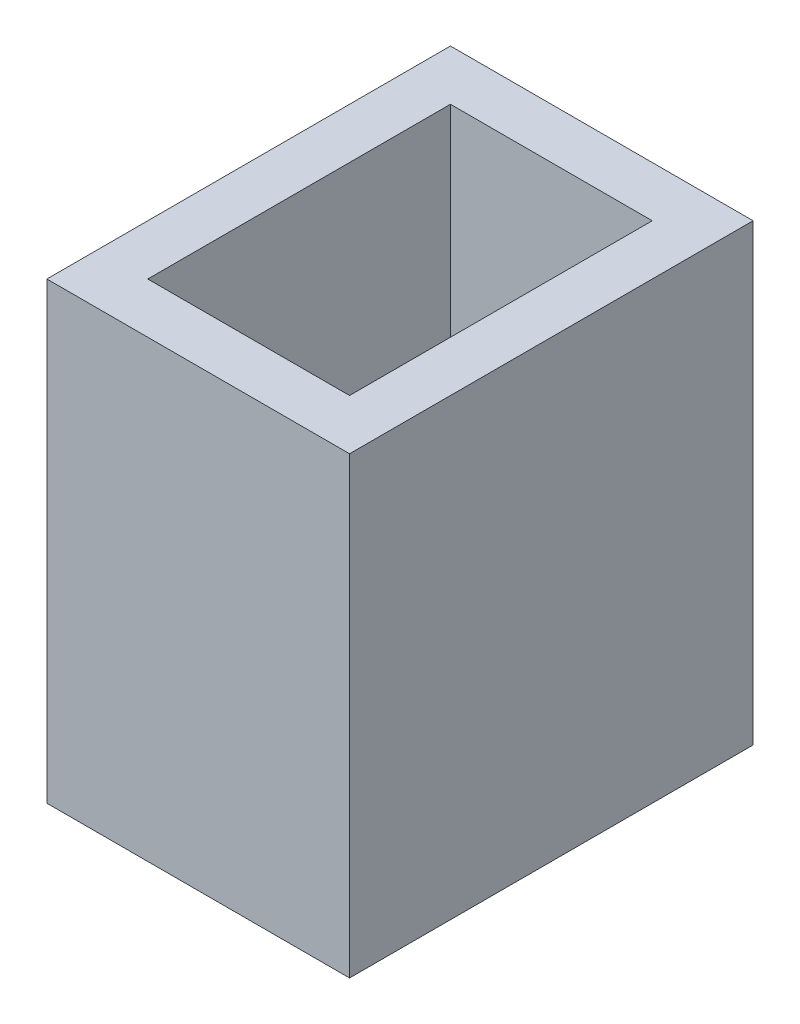
ISO-10303-21;
HEADER;
FILE_DESCRIPTION(('STEP AP214'),'2;1');
FILE_NAME('part.step','',(''),(''),'','','');
FILE_SCHEMA(('AUTOMOTIVE_DESIGN { 1 0 10303 214 1 1 1 1 }'));
ENDSEC;
DATA;
#1=APPLICATION_CONTEXT('core data for automotive mechanical design processes');
#2=APPLICATION_PROTOCOL_DEFINITION('international standard','automotive_design',2000,#1);
#3=PRODUCT_CONTEXT('',#1,'mechanical');
#4=PRODUCT('Part','Part','',(#3));
#5=PRODUCT_RELATED_PRODUCT_CATEGORY('part','',(#4));
#6=PRODUCT_DEFINITION_FORMATION('','',#4);
#7=PRODUCT_DEFINITION_CONTEXT('part definition',#1,'design');
#8=PRODUCT_DEFINITION('design','',#6,#7);
#9=PRODUCT_DEFINITION_SHAPE('','',#8);
#10=(LENGTH_UNIT() NAMED_UNIT(*) SI_UNIT(.MILLI.,.METRE.));
#11=(NAMED_UNIT(*) PLANE_ANGLE_UNIT() SI_UNIT($,.RADIAN.));
#12=(NAMED_UNIT(*) SI_UNIT($,.STERADIAN.) SOLID_ANGLE_UNIT());
#13=UNCERTAINTY_MEASURE_WITH_UNIT(LENGTH_MEASURE(1.E-05),#10,'distance_accuracy_value','');
#14=(GEOMETRIC_REPRESENTATION_CONTEXT(3) GLOBAL_UNCERTAINTY_ASSIGNED_CONTEXT((#13)) GLOBAL_UNIT_ASSIGNED_CONTEXT((#10,
#11,#12)) REPRESENTATION_CONTEXT('',''));
#15=CARTESIAN_POINT('',(0.,0.,0.));
#16=DIRECTION('',(0.,0.,1.));
#17=DIRECTION('',(1.,0.,0.));
#18=AXIS2_PLACEMENT_3D('',#15,#16,#17);
#19=CARTESIAN_POINT('',(0.,18.,0.));
#20=DIRECTION('',(0.,-1.,0.));
#21=DIRECTION('',(0.,0.,-1.));
#22=AXIS2_PLACEMENT_3D('',#19,#20,#21);
#23=PLANE('',#22);
#24=DIRECTION('',(0.,0.,1.));
#25=VECTOR('',#24,1.);
#26=CARTESIAN_POINT('',(0.,18.,0.));
#27=LINE('',#26,#25);
#28=CARTESIAN_POINT('',(0.,18.,-16.));
#29=VERTEX_POINT('',#28);
#30=CARTESIAN_POINT('',(0.,18.,0.));
#31=VERTEX_POINT('',#30);
#32=EDGE_CURVE('E165',#29,#31,#27,.T.);
#33=ORIENTED_EDGE('',*,*,#32,.T.);
#34=DIRECTION('',(1.,0.,0.));
#35=VECTOR('',#34,1.);
#36=CARTESIAN_POINT('',(0.,18.,0.));
#37=LINE('',#36,#35);
#38=CARTESIAN_POINT('',(12.,18.,0.));
#39=VERTEX_POINT('',#38);
#40=EDGE_CURVE('E100',#31,#39,#37,.T.);
#41=ORIENTED_EDGE('',*,*,#40,.T.);
#42=DIRECTION('',(0.,0.,-1.));
#43=VECTOR('',#42,1.);
#44=CARTESIAN_POINT('',(12.,18.,0.));
#45=LINE('',#44,#43);
#46=CARTESIAN_POINT('',(12.,18.,-16.));
#47=VERTEX_POINT('',#46);
#48=EDGE_CURVE('E170',#39,#47,#45,.T.);
#49=ORIENTED_EDGE('',*,*,#48,.T.);
#50=DIRECTION('',(-1.,0.,0.));
#51=VECTOR('',#50,1.);
#52=CARTESIAN_POINT('',(0.,18.,-16.));
#53=LINE('',#52,#51);
#54=EDGE_CURVE('E72',#47,#29,#53,.T.);
#55=ORIENTED_EDGE('',*,*,#54,.T.);
#56=EDGE_LOOP('',(#33,#41,#49,#55));
#57=FACE_BOUND('',#56,.T.);
#58=DIRECTION('',(0.,0.,1.));
#59=VECTOR('',#58,1.);
#60=CARTESIAN_POINT('',(2.,18.,0.));
#61=LINE('',#60,#59);
#62=CARTESIAN_POINT('',(2.,18.,-14.));
#63=VERTEX_POINT('',#62);
#64=CARTESIAN_POINT('',(2.,18.,-2.));
#65=VERTEX_POINT('',#64);
#66=EDGE_CURVE('E149',#63,#65,#61,.T.);
#67=ORIENTED_EDGE('',*,*,#66,.F.);
#68=DIRECTION('',(-1.,0.,0.));
#69=VECTOR('',#68,1.);
#70=CARTESIAN_POINT('',(0.,18.,-14.));
#71=LINE('',#70,#69);
#72=CARTESIAN_POINT('',(10.,18.,-14.));
#73=VERTEX_POINT('',#72);
#74=EDGE_CURVE('E162',#73,#63,#71,.T.);
#75=ORIENTED_EDGE('',*,*,#74,.F.);
#76=DIRECTION('',(0.,0.,-1.));
#77=VECTOR('',#76,1.);
#78=CARTESIAN_POINT('',(10.,18.,0.));
#79=LINE('',#78,#77);
#80=CARTESIAN_POINT('',(10.,18.,-2.));
#81=VERTEX_POINT('',#80);
#82=EDGE_CURVE('E159',#81,#73,#79,.T.);
#83=ORIENTED_EDGE('',*,*,#82,.F.);
#84=DIRECTION('',(1.,0.,0.));
#85=VECTOR('',#84,1.);
#86=CARTESIAN_POINT('',(0.,18.,-2.));
#87=LINE('',#86,#85);
#88=EDGE_CURVE('E138',#65,#81,#87,.T.);
#89=ORIENTED_EDGE('',*,*,#88,.F.);
#90=EDGE_LOOP('',(#67,#75,#83,#89));
#91=FACE_BOUND('',#90,.T.);
#92=ADVANCED_FACE('F45',(#57,#91),#23,.F.);
#93=CARTESIAN_POINT('',(0.,18.,0.));
#94=DIRECTION('',(1.,0.,0.));
#95=DIRECTION('',(0.,0.,-1.));
#96=AXIS2_PLACEMENT_3D('',#93,#94,#95);
#97=PLANE('',#96);
#98=DIRECTION('',(0.,0.,1.));
#99=VECTOR('',#98,1.);
#100=CARTESIAN_POINT('',(0.,0.,0.));
#101=LINE('',#100,#99);
#102=CARTESIAN_POINT('',(0.,0.,-16.));
#103=VERTEX_POINT('',#102);
#104=CARTESIAN_POINT('',(0.,0.,0.));
#105=VERTEX_POINT('',#104);
#106=EDGE_CURVE('E176',#103,#105,#101,.T.);
#107=ORIENTED_EDGE('',*,*,#106,.T.);
#108=DIRECTION('',(0.,-1.,0.));
#109=VECTOR('',#108,1.);
#110=CARTESIAN_POINT('',(0.,18.,0.));
#111=LINE('',#110,#109);
#112=EDGE_CURVE('E11',#31,#105,#111,.T.);
#113=ORIENTED_EDGE('',*,*,#112,.F.);
#114=ORIENTED_EDGE('',*,*,#32,.F.);
#115=DIRECTION('',(0.,-1.,0.));
#116=VECTOR('',#115,1.);
#117=CARTESIAN_POINT('',(0.,18.,-16.));
#118=LINE('',#117,#116);
#119=EDGE_CURVE('E175',#29,#103,#118,.T.);
#120=ORIENTED_EDGE('',*,*,#119,.T.);
#121=EDGE_LOOP('',(#107,#113,#114,#120));
#122=FACE_BOUND('',#121,.T.);
#123=ADVANCED_FACE('F47',(#122),#97,.F.);
#124=CARTESIAN_POINT('',(0.,18.,0.));
#125=DIRECTION('',(0.,0.,-1.));
#126=DIRECTION('',(-1.,0.,0.));
#127=AXIS2_PLACEMENT_3D('',#124,#125,#126);
#128=PLANE('',#127);
#129=DIRECTION('',(1.,0.,0.));
#130=VECTOR('',#129,1.);
#131=CARTESIAN_POINT('',(0.,0.,0.));
#132=LINE('',#131,#130);
#133=CARTESIAN_POINT('',(12.,0.,0.));
#134=VERTEX_POINT('',#133);
#135=EDGE_CURVE('E180',#105,#134,#132,.T.);
#136=ORIENTED_EDGE('',*,*,#135,.T.);
#137=DIRECTION('',(0.,-1.,0.));
#138=VECTOR('',#137,1.);
#139=CARTESIAN_POINT('',(12.,18.,0.));
#140=LINE('',#139,#138);
#141=EDGE_CURVE('E55',#39,#134,#140,.T.);
#142=ORIENTED_EDGE('',*,*,#141,.F.);
#143=ORIENTED_EDGE('',*,*,#40,.F.);
#144=ORIENTED_EDGE('',*,*,#112,.T.);
#145=EDGE_LOOP('',(#136,#142,#143,#144));
#146=FACE_BOUND('',#145,.T.);
#147=ADVANCED_FACE('F230',(#146),#128,.F.);
#148=CARTESIAN_POINT('',(12.,18.,0.));
#149=DIRECTION('',(-1.,0.,0.));
#150=DIRECTION('',(0.,0.,1.));
#151=AXIS2_PLACEMENT_3D('',#148,#149,#150);
#152=PLANE('',#151);
#153=DIRECTION('',(0.,0.,-1.));
#154=VECTOR('',#153,1.);
#155=CARTESIAN_POINT('',(12.,0.,0.));
#156=LINE('',#155,#154);
#157=CARTESIAN_POINT('',(12.,0.,-16.));
#158=VERTEX_POINT('',#157);
#159=EDGE_CURVE('E183',#134,#158,#156,.T.);
#160=ORIENTED_EDGE('',*,*,#159,.T.);
#161=DIRECTION('',(0.,-1.,0.));
#162=VECTOR('',#161,1.);
#163=CARTESIAN_POINT('',(12.,18.,-16.));
#164=LINE('',#163,#162);
#165=EDGE_CURVE('E190',#47,#158,#164,.T.);
#166=ORIENTED_EDGE('',*,*,#165,.F.);
#167=ORIENTED_EDGE('',*,*,#48,.F.);
#168=ORIENTED_EDGE('',*,*,#141,.T.);
#169=EDGE_LOOP('',(#160,#166,#167,#168));
#170=FACE_BOUND('',#169,.T.);
#171=ADVANCED_FACE('F242',(#170),#152,.F.);
#172=CARTESIAN_POINT('',(0.,18.,-16.));
#173=DIRECTION('',(0.,0.,1.));
#174=DIRECTION('',(1.,0.,0.));
#175=AXIS2_PLACEMENT_3D('',#172,#173,#174);
#176=PLANE('',#175);
#177=DIRECTION('',(-1.,0.,0.));
#178=VECTOR('',#177,1.);
#179=CARTESIAN_POINT('',(0.,0.,-16.));
#180=LINE('',#179,#178);
#181=EDGE_CURVE('E93',#158,#103,#180,.T.);
#182=ORIENTED_EDGE('',*,*,#181,.T.);
#183=ORIENTED_EDGE('',*,*,#119,.F.);
#184=ORIENTED_EDGE('',*,*,#54,.F.);
#185=ORIENTED_EDGE('',*,*,#165,.T.);
#186=EDGE_LOOP('',(#182,#183,#184,#185));
#187=FACE_BOUND('',#186,.T.);
#188=ADVANCED_FACE('F238',(#187),#176,.F.);
#189=CARTESIAN_POINT('',(0.,0.,0.));
#190=DIRECTION('',(0.,-1.,0.));
#191=DIRECTION('',(0.,0.,-1.));
#192=AXIS2_PLACEMENT_3D('',#189,#190,#191);
#193=PLANE('',#192);
#194=CARTESIAN_POINT('',(4.77011472098124,0.,-11.783836205576));
#195=DIRECTION('',(0.,-1.,0.));
#196=DIRECTION('',(0.,0.,-1.));
#197=AXIS2_PLACEMENT_3D('',#194,#195,#196);
#198=CIRCLE('',#197,0.75);
#199=CARTESIAN_POINT('',(4.77011472098124,0.,-12.533836205576));
#200=VERTEX_POINT('',#199);
#201=EDGE_CURVE('E386',#200,#200,#198,.T.);
#202=ORIENTED_EDGE('',*,*,#201,.F.);
#203=EDGE_LOOP('',(#202));
#204=FACE_BOUND('',#203,.T.);
#205=CARTESIAN_POINT('',(4.77011472159648,0.,-4.16383620557599));
#206=DIRECTION('',(0.,-1.,0.));
#207=DIRECTION('',(0.,0.,-1.));
#208=AXIS2_PLACEMENT_3D('',#205,#206,#207);
#209=CIRCLE('',#208,0.75);
#210=CARTESIAN_POINT('',(4.77011472159648,0.,-4.913836205576));
#211=VERTEX_POINT('',#210);
#212=EDGE_CURVE('E388',#211,#211,#209,.T.);
#213=ORIENTED_EDGE('',*,*,#212,.F.);
#214=EDGE_LOOP('',(#213));
#215=FACE_BOUND('',#214,.T.);
#216=CARTESIAN_POINT('',(4.77011472159674,0.,-6.70383620557594));
#217=DIRECTION('',(0.,-1.,0.));
#218=DIRECTION('',(0.,0.,-1.));
#219=AXIS2_PLACEMENT_3D('',#216,#217,#218);
#220=CIRCLE('',#219,0.75);
#221=CARTESIAN_POINT('',(4.77011472159674,0.,-7.45383620557594));
#222=VERTEX_POINT('',#221);
#223=EDGE_CURVE('E200',#222,#222,#220,.T.);
#224=ORIENTED_EDGE('',*,*,#223,.F.);
#225=EDGE_LOOP('',(#224));
#226=FACE_BOUND('',#225,.T.);
#227=ORIENTED_EDGE('',*,*,#106,.F.);
#228=ORIENTED_EDGE('',*,*,#181,.F.);
#229=ORIENTED_EDGE('',*,*,#159,.F.);
#230=ORIENTED_EDGE('',*,*,#135,.F.);
#231=EDGE_LOOP('',(#227,#228,#229,#230));
#232=FACE_BOUND('',#231,.T.);
#233=ADVANCED_FACE('F235',(#204,#215,#226,#232),#193,.T.);
#234=CARTESIAN_POINT('',(2.,18.,0.));
#235=DIRECTION('',(1.,0.,0.));
#236=DIRECTION('',(0.,0.,-1.));
#237=AXIS2_PLACEMENT_3D('',#234,#235,#236);
#238=PLANE('',#237);
#239=DIRECTION('',(0.,0.,1.));
#240=VECTOR('',#239,1.);
#241=CARTESIAN_POINT('',(2.,2.,0.));
#242=LINE('',#241,#240);
#243=CARTESIAN_POINT('',(2.,2.,-14.));
#244=VERTEX_POINT('',#243);
#245=CARTESIAN_POINT('',(2.,2.,-2.));
#246=VERTEX_POINT('',#245);
#247=EDGE_CURVE('E128',#244,#246,#242,.T.);
#248=ORIENTED_EDGE('',*,*,#247,.F.);
#249=DIRECTION('',(0.,-1.,0.));
#250=VECTOR('',#249,1.);
#251=CARTESIAN_POINT('',(2.,18.,-14.));
#252=LINE('',#251,#250);
#253=EDGE_CURVE('E153',#63,#244,#252,.T.);
#254=ORIENTED_EDGE('',*,*,#253,.F.);
#255=ORIENTED_EDGE('',*,*,#66,.T.);
#256=DIRECTION('',(0.,-1.,0.));
#257=VECTOR('',#256,1.);
#258=CARTESIAN_POINT('',(2.,18.,-2.));
#259=LINE('',#258,#257);
#260=EDGE_CURVE('E142',#65,#246,#259,.T.);
#261=ORIENTED_EDGE('',*,*,#260,.T.);
#262=EDGE_LOOP('',(#248,#254,#255,#261));
#263=FACE_BOUND('',#262,.T.);
#264=ADVANCED_FACE('F223',(#263),#238,.T.);
#265=CARTESIAN_POINT('',(0.,18.,-2.));
#266=DIRECTION('',(0.,0.,-1.));
#267=DIRECTION('',(-1.,0.,0.));
#268=AXIS2_PLACEMENT_3D('',#265,#266,#267);
#269=PLANE('',#268);
#270=DIRECTION('',(1.,0.,0.));
#271=VECTOR('',#270,1.);
#272=CARTESIAN_POINT('',(0.,2.,-2.));
#273=LINE('',#272,#271);
#274=CARTESIAN_POINT('',(10.,2.,-2.));
#275=VERTEX_POINT('',#274);
#276=EDGE_CURVE('E122',#246,#275,#273,.T.);
#277=ORIENTED_EDGE('',*,*,#276,.F.);
#278=ORIENTED_EDGE('',*,*,#260,.F.);
#279=ORIENTED_EDGE('',*,*,#88,.T.);
#280=DIRECTION('',(0.,-1.,0.));
#281=VECTOR('',#280,1.);
#282=CARTESIAN_POINT('',(10.,18.,-2.));
#283=LINE('',#282,#281);
#284=EDGE_CURVE('E135',#81,#275,#283,.T.);
#285=ORIENTED_EDGE('',*,*,#284,.T.);
#286=EDGE_LOOP('',(#277,#278,#279,#285));
#287=FACE_BOUND('',#286,.T.);
#288=ADVANCED_FACE('F136',(#287),#269,.T.);
#289=CARTESIAN_POINT('',(10.,18.,0.));
#290=DIRECTION('',(-1.,0.,0.));
#291=DIRECTION('',(0.,0.,1.));
#292=AXIS2_PLACEMENT_3D('',#289,#290,#291);
#293=PLANE('',#292);
#294=DIRECTION('',(0.,0.,-1.));
#295=VECTOR('',#294,1.);
#296=CARTESIAN_POINT('',(10.,2.,0.));
#297=LINE('',#296,#295);
#298=CARTESIAN_POINT('',(10.,2.,-14.));
#299=VERTEX_POINT('',#298);
#300=EDGE_CURVE('E126',#275,#299,#297,.T.);
#301=ORIENTED_EDGE('',*,*,#300,.F.);
#302=ORIENTED_EDGE('',*,*,#284,.F.);
#303=ORIENTED_EDGE('',*,*,#82,.T.);
#304=DIRECTION('',(0.,-1.,0.));
#305=VECTOR('',#304,1.);
#306=CARTESIAN_POINT('',(10.,18.,-14.));
#307=LINE('',#306,#305);
#308=EDGE_CURVE('E63',#73,#299,#307,.T.);
#309=ORIENTED_EDGE('',*,*,#308,.T.);
#310=EDGE_LOOP('',(#301,#302,#303,#309));
#311=FACE_BOUND('',#310,.T.);
#312=ADVANCED_FACE('F144',(#311),#293,.T.);
#313=CARTESIAN_POINT('',(0.,18.,-14.));
#314=DIRECTION('',(0.,0.,1.));
#315=DIRECTION('',(1.,0.,0.));
#316=AXIS2_PLACEMENT_3D('',#313,#314,#315);
#317=PLANE('',#316);
#318=DIRECTION('',(-1.,0.,0.));
#319=VECTOR('',#318,1.);
#320=CARTESIAN_POINT('',(0.,2.,-14.));
#321=LINE('',#320,#319);
#322=EDGE_CURVE('E146',#299,#244,#321,.T.);
#323=ORIENTED_EDGE('',*,*,#322,.F.);
#324=ORIENTED_EDGE('',*,*,#308,.F.);
#325=ORIENTED_EDGE('',*,*,#74,.T.);
#326=ORIENTED_EDGE('',*,*,#253,.T.);
#327=EDGE_LOOP('',(#323,#324,#325,#326));
#328=FACE_BOUND('',#327,.T.);
#329=ADVANCED_FACE('F219',(#328),#317,.T.);
#330=CARTESIAN_POINT('',(0.,2.,0.));
#331=DIRECTION('',(0.,-1.,0.));
#332=DIRECTION('',(0.,0.,-1.));
#333=AXIS2_PLACEMENT_3D('',#330,#331,#332);
#334=PLANE('',#333);
#335=CARTESIAN_POINT('',(4.77011472098124,2.,-11.783836205576));
#336=DIRECTION('',(0.,-1.,0.));
#337=DIRECTION('',(0.,0.,-1.));
#338=AXIS2_PLACEMENT_3D('',#335,#336,#337);
#339=CIRCLE('',#338,0.75);
#340=CARTESIAN_POINT('',(4.77011472098124,2.,-12.533836205576));
#341=VERTEX_POINT('',#340);
#342=EDGE_CURVE('E49',#341,#341,#339,.T.);
#343=ORIENTED_EDGE('',*,*,#342,.T.);
#344=EDGE_LOOP('',(#343));
#345=FACE_BOUND('',#344,.T.);
#346=CARTESIAN_POINT('',(4.77011472159648,2.,-4.16383620557599));
#347=DIRECTION('',(0.,-1.,0.));
#348=DIRECTION('',(0.,0.,-1.));
#349=AXIS2_PLACEMENT_3D('',#346,#347,#348);
#350=CIRCLE('',#349,0.75);
#351=CARTESIAN_POINT('',(4.77011472159648,2.,-4.913836205576));
#352=VERTEX_POINT('',#351);
#353=EDGE_CURVE('E199',#352,#352,#350,.T.);
#354=ORIENTED_EDGE('',*,*,#353,.T.);
#355=EDGE_LOOP('',(#354));
#356=FACE_BOUND('',#355,.T.);
#357=CARTESIAN_POINT('',(4.77011472159674,2.,-6.70383620557594));
#358=DIRECTION('',(0.,-1.,0.));
#359=DIRECTION('',(0.,0.,-1.));
#360=AXIS2_PLACEMENT_3D('',#357,#358,#359);
#361=CIRCLE('',#360,0.75);
#362=CARTESIAN_POINT('',(4.77011472159674,2.,-7.45383620557594));
#363=VERTEX_POINT('',#362);
#364=EDGE_CURVE('E196',#363,#363,#361,.T.);
#365=ORIENTED_EDGE('',*,*,#364,.T.);
#366=EDGE_LOOP('',(#365));
#367=FACE_BOUND('',#366,.T.);
#368=ORIENTED_EDGE('',*,*,#247,.T.);
#369=ORIENTED_EDGE('',*,*,#276,.T.);
#370=ORIENTED_EDGE('',*,*,#300,.T.);
#371=ORIENTED_EDGE('',*,*,#322,.T.);
#372=EDGE_LOOP('',(#368,#369,#370,#371));
#373=FACE_BOUND('',#372,.T.);
#374=ADVANCED_FACE('F124',(#345,#356,#367,#373),#334,.F.);
#375=CARTESIAN_POINT('',(4.77011472159674,10.,-6.70383620557594));
#376=DIRECTION('',(0.,-1.,0.));
#377=DIRECTION('',(0.,0.,-1.));
#378=AXIS2_PLACEMENT_3D('',#375,#376,#377);
#379=CYLINDRICAL_SURFACE('',#378,0.75);
#380=ORIENTED_EDGE('',*,*,#223,.T.);
#381=EDGE_LOOP('',(#380));
#382=FACE_BOUND('',#381,.T.);
#383=ORIENTED_EDGE('',*,*,#364,.F.);
#384=EDGE_LOOP('',(#383));
#385=FACE_BOUND('',#384,.T.);
#386=ADVANCED_FACE('F298',(#382,#385),#379,.F.);
#387=CARTESIAN_POINT('',(4.77011472159648,10.,-4.16383620557599));
#388=DIRECTION('',(0.,-1.,0.));
#389=DIRECTION('',(0.,0.,-1.));
#390=AXIS2_PLACEMENT_3D('',#387,#388,#389);
#391=CYLINDRICAL_SURFACE('',#390,0.75);
#392=ORIENTED_EDGE('',*,*,#212,.T.);
#393=EDGE_LOOP('',(#392));
#394=FACE_BOUND('',#393,.T.);
#395=ORIENTED_EDGE('',*,*,#353,.F.);
#396=EDGE_LOOP('',(#395));
#397=FACE_BOUND('',#396,.T.);
#398=ADVANCED_FACE('F304',(#394,#397),#391,.F.);
#399=CARTESIAN_POINT('',(4.77011472098124,10.,-11.783836205576));
#400=DIRECTION('',(0.,-1.,0.));
#401=DIRECTION('',(0.,0.,-1.));
#402=AXIS2_PLACEMENT_3D('',#399,#400,#401);
#403=CYLINDRICAL_SURFACE('',#402,0.75);
#404=ORIENTED_EDGE('',*,*,#201,.T.);
#405=EDGE_LOOP('',(#404));
#406=FACE_BOUND('',#405,.T.);
#407=ORIENTED_EDGE('',*,*,#342,.F.);
#408=EDGE_LOOP('',(#407));
#409=FACE_BOUND('',#408,.T.);
#410=ADVANCED_FACE('F312',(#406,#409),#403,.F.);
#411=CLOSED_SHELL('',(#92,#123,#147,#171,#188,#233,#264,#288,#312,#329,#374,#386,#398,#410));
#412=MANIFOLD_SOLID_BREP('B2',#411);
#413=ADVANCED_BREP_SHAPE_REPRESENTATION('',(#18,#412),#14);
#414=SHAPE_DEFINITION_REPRESENTATION(#9,#413);
ENDSEC;
END-ISO-10303-21;
